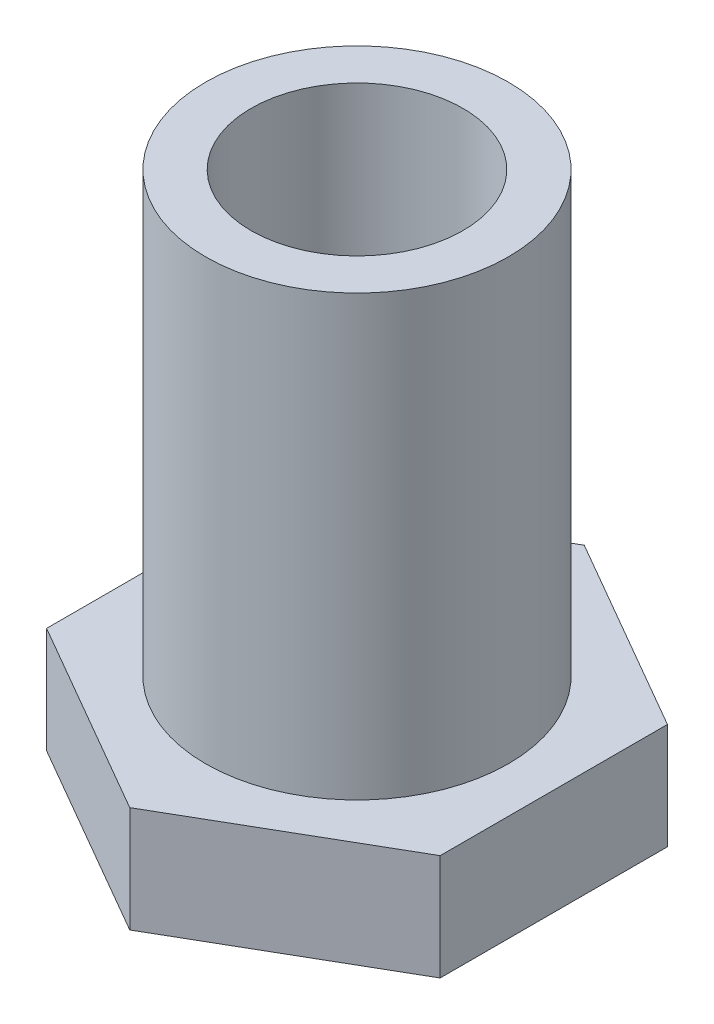
ISO-10303-21;
HEADER;
FILE_DESCRIPTION(('STEP AP214'),'2;1');
FILE_NAME('part.step','',(''),(''),'','','');
FILE_SCHEMA(('AUTOMOTIVE_DESIGN { 1 0 10303 214 1 1 1 1 }'));
ENDSEC;
DATA;
#1=APPLICATION_CONTEXT('core data for automotive mechanical design processes');
#2=APPLICATION_PROTOCOL_DEFINITION('international standard','automotive_design',2000,#1);
#3=PRODUCT_CONTEXT('',#1,'mechanical');
#4=PRODUCT('Part','Part','',(#3));
#5=PRODUCT_RELATED_PRODUCT_CATEGORY('part','',(#4));
#6=PRODUCT_DEFINITION_FORMATION('','',#4);
#7=PRODUCT_DEFINITION_CONTEXT('part definition',#1,'design');
#8=PRODUCT_DEFINITION('design','',#6,#7);
#9=PRODUCT_DEFINITION_SHAPE('','',#8);
#10=(LENGTH_UNIT() NAMED_UNIT(*) SI_UNIT(.MILLI.,.METRE.));
#11=(NAMED_UNIT(*) PLANE_ANGLE_UNIT() SI_UNIT($,.RADIAN.));
#12=(NAMED_UNIT(*) SI_UNIT($,.STERADIAN.) SOLID_ANGLE_UNIT());
#13=UNCERTAINTY_MEASURE_WITH_UNIT(LENGTH_MEASURE(1.E-05),#10,'distance_accuracy_value','');
#14=(GEOMETRIC_REPRESENTATION_CONTEXT(3) GLOBAL_UNCERTAINTY_ASSIGNED_CONTEXT((#13)) GLOBAL_UNIT_ASSIGNED_CONTEXT((#10,
#11,#12)) REPRESENTATION_CONTEXT('',''));
#15=CARTESIAN_POINT('',(0.,0.,0.));
#16=DIRECTION('',(0.,0.,1.));
#17=DIRECTION('',(1.,0.,0.));
#18=AXIS2_PLACEMENT_3D('',#15,#16,#17);
#19=CARTESIAN_POINT('',(0.,18.,0.));
#20=DIRECTION('',(0.,-1.,0.));
#21=DIRECTION('',(0.,0.,-1.));
#22=AXIS2_PLACEMENT_3D('',#19,#20,#21);
#23=CYLINDRICAL_SURFACE('',#22,3.5);
#24=CARTESIAN_POINT('',(0.,18.,0.));
#25=DIRECTION('',(0.,1.,0.));
#26=DIRECTION('',(0.,0.,1.));
#27=AXIS2_PLACEMENT_3D('',#24,#25,#26);
#28=CIRCLE('',#27,3.5);
#29=CARTESIAN_POINT('',(0.,18.,3.5));
#30=VERTEX_POINT('',#29);
#31=EDGE_CURVE('E49',#30,#30,#28,.T.);
#32=ORIENTED_EDGE('',*,*,#31,.T.);
#33=EDGE_LOOP('',(#32));
#34=FACE_BOUND('',#33,.T.);
#35=CARTESIAN_POINT('',(0.,0.,0.));
#36=DIRECTION('',(0.,1.,0.));
#37=DIRECTION('',(0.,0.,1.));
#38=AXIS2_PLACEMENT_3D('',#35,#36,#37);
#39=CIRCLE('',#38,3.5);
#40=CARTESIAN_POINT('',(0.,0.,3.5));
#41=VERTEX_POINT('',#40);
#42=EDGE_CURVE('E43',#41,#41,#39,.T.);
#43=ORIENTED_EDGE('',*,*,#42,.F.);
#44=EDGE_LOOP('',(#43));
#45=FACE_BOUND('',#44,.T.);
#46=ADVANCED_FACE('F40',(#34,#45),#23,.F.);
#47=CARTESIAN_POINT('',(0.,18.,0.));
#48=DIRECTION('',(0.,-1.,0.));
#49=DIRECTION('',(0.,0.,-1.));
#50=AXIS2_PLACEMENT_3D('',#47,#48,#49);
#51=CYLINDRICAL_SURFACE('',#50,5.);
#52=CARTESIAN_POINT('',(0.,3.5,0.));
#53=DIRECTION('',(0.,1.,0.));
#54=DIRECTION('',(0.,0.,1.));
#55=AXIS2_PLACEMENT_3D('',#52,#53,#54);
#56=CIRCLE('',#55,5.);
#57=CARTESIAN_POINT('',(0.,3.5,5.));
#58=VERTEX_POINT('',#57);
#59=EDGE_CURVE('E139',#58,#58,#56,.T.);
#60=ORIENTED_EDGE('',*,*,#59,.T.);
#61=EDGE_LOOP('',(#60));
#62=FACE_BOUND('',#61,.T.);
#63=CARTESIAN_POINT('',(0.,18.,0.));
#64=DIRECTION('',(0.,1.,0.));
#65=DIRECTION('',(0.,0.,1.));
#66=AXIS2_PLACEMENT_3D('',#63,#64,#65);
#67=CIRCLE('',#66,5.);
#68=CARTESIAN_POINT('',(0.,18.,5.));
#69=VERTEX_POINT('',#68);
#70=EDGE_CURVE('E11',#69,#69,#67,.T.);
#71=ORIENTED_EDGE('',*,*,#70,.F.);
#72=EDGE_LOOP('',(#71));
#73=FACE_BOUND('',#72,.T.);
#74=ADVANCED_FACE('F160',(#62,#73),#51,.T.);
#75=CARTESIAN_POINT('',(0.,18.,0.));
#76=DIRECTION('',(0.,1.,0.));
#77=DIRECTION('',(0.,0.,1.));
#78=AXIS2_PLACEMENT_3D('',#75,#76,#77);
#79=PLANE('',#78);
#80=ORIENTED_EDGE('',*,*,#31,.F.);
#81=EDGE_LOOP('',(#80));
#82=FACE_BOUND('',#81,.T.);
#83=ORIENTED_EDGE('',*,*,#70,.T.);
#84=EDGE_LOOP('',(#83));
#85=FACE_BOUND('',#84,.T.);
#86=ADVANCED_FACE('F164',(#82,#85),#79,.T.);
#87=CARTESIAN_POINT('',(0.,0.,0.));
#88=DIRECTION('',(0.,1.,0.));
#89=DIRECTION('',(0.,0.,1.));
#90=AXIS2_PLACEMENT_3D('',#87,#88,#89);
#91=PLANE('',#90);
#92=ORIENTED_EDGE('',*,*,#42,.T.);
#93=EDGE_LOOP('',(#92));
#94=FACE_BOUND('',#93,.T.);
#95=DIRECTION('',(0.,0.,-1.));
#96=VECTOR('',#95,1.);
#97=CARTESIAN_POINT('',(6.5,0.,0.));
#98=LINE('',#97,#96);
#99=CARTESIAN_POINT('',(6.5,0.,3.75277674973258));
#100=VERTEX_POINT('',#99);
#101=CARTESIAN_POINT('',(6.5,0.,-3.75277674973257));
#102=VERTEX_POINT('',#101);
#103=EDGE_CURVE('E129',#100,#102,#98,.T.);
#104=ORIENTED_EDGE('',*,*,#103,.F.);
#105=DIRECTION('',(0.866025403784439,0.,-0.5));
#106=VECTOR('',#105,1.);
#107=CARTESIAN_POINT('',(3.25,0.,5.62916512459886));
#108=LINE('',#107,#106);
#109=CARTESIAN_POINT('',(0.,0.,7.50555349946514));
#110=VERTEX_POINT('',#109);
#111=EDGE_CURVE('E88',#110,#100,#108,.T.);
#112=ORIENTED_EDGE('',*,*,#111,.F.);
#113=DIRECTION('',(0.866025403784439,0.,0.5));
#114=VECTOR('',#113,1.);
#115=CARTESIAN_POINT('',(-3.25000000000001,0.,5.62916512459886));
#116=LINE('',#115,#114);
#117=CARTESIAN_POINT('',(-6.5,0.,3.75277674973257));
#118=VERTEX_POINT('',#117);
#119=EDGE_CURVE('E82',#118,#110,#116,.T.);
#120=ORIENTED_EDGE('',*,*,#119,.F.);
#121=DIRECTION('',(0.,0.,1.));
#122=VECTOR('',#121,1.);
#123=CARTESIAN_POINT('',(-6.5,0.,0.));
#124=LINE('',#123,#122);
#125=CARTESIAN_POINT('',(-6.5,0.,-3.75277674973257));
#126=VERTEX_POINT('',#125);
#127=EDGE_CURVE('E118',#126,#118,#124,.T.);
#128=ORIENTED_EDGE('',*,*,#127,.F.);
#129=DIRECTION('',(-0.866025403784439,0.,0.5));
#130=VECTOR('',#129,1.);
#131=CARTESIAN_POINT('',(-3.25,0.,-5.62916512459885));
#132=LINE('',#131,#130);
#133=CARTESIAN_POINT('',(0.,0.,-7.50555349946514));
#134=VERTEX_POINT('',#133);
#135=EDGE_CURVE('E134',#134,#126,#132,.T.);
#136=ORIENTED_EDGE('',*,*,#135,.F.);
#137=DIRECTION('',(-0.866025403784439,0.,-0.5));
#138=VECTOR('',#137,1.);
#139=CARTESIAN_POINT('',(3.25,0.,-5.62916512459885));
#140=LINE('',#139,#138);
#141=EDGE_CURVE('E132',#102,#134,#140,.T.);
#142=ORIENTED_EDGE('',*,*,#141,.F.);
#143=EDGE_LOOP('',(#104,#112,#120,#128,#136,#142));
#144=FACE_BOUND('',#143,.T.);
#145=ADVANCED_FACE('F156',(#94,#144),#91,.F.);
#146=CARTESIAN_POINT('',(6.5,3.5,0.));
#147=DIRECTION('',(-1.,0.,0.));
#148=DIRECTION('',(0.,0.,1.));
#149=AXIS2_PLACEMENT_3D('',#146,#147,#148);
#150=PLANE('',#149);
#151=ORIENTED_EDGE('',*,*,#103,.T.);
#152=DIRECTION('',(0.,-1.,0.));
#153=VECTOR('',#152,1.);
#154=CARTESIAN_POINT('',(6.5,3.5,-3.75277674973257));
#155=LINE('',#154,#153);
#156=CARTESIAN_POINT('',(6.5,3.5,-3.75277674973257));
#157=VERTEX_POINT('',#156);
#158=EDGE_CURVE('E147',#157,#102,#155,.T.);
#159=ORIENTED_EDGE('',*,*,#158,.F.);
#160=DIRECTION('',(0.,0.,-1.));
#161=VECTOR('',#160,1.);
#162=CARTESIAN_POINT('',(6.5,3.5,0.));
#163=LINE('',#162,#161);
#164=CARTESIAN_POINT('',(6.5,3.5,3.75277674973258));
#165=VERTEX_POINT('',#164);
#166=EDGE_CURVE('E200',#165,#157,#163,.T.);
#167=ORIENTED_EDGE('',*,*,#166,.F.);
#168=DIRECTION('',(0.,-1.,0.));
#169=VECTOR('',#168,1.);
#170=CARTESIAN_POINT('',(6.5,3.5,3.75277674973258));
#171=LINE('',#170,#169);
#172=EDGE_CURVE('E125',#165,#100,#171,.T.);
#173=ORIENTED_EDGE('',*,*,#172,.T.);
#174=EDGE_LOOP('',(#151,#159,#167,#173));
#175=FACE_BOUND('',#174,.T.);
#176=ADVANCED_FACE('F175',(#175),#150,.F.);
#177=CARTESIAN_POINT('',(3.25,3.5,-5.62916512459885));
#178=DIRECTION('',(-0.5,0.,0.866025403784439));
#179=DIRECTION('',(0.866025403784439,0.,0.5));
#180=AXIS2_PLACEMENT_3D('',#177,#178,#179);
#181=PLANE('',#180);
#182=ORIENTED_EDGE('',*,*,#141,.T.);
#183=DIRECTION('',(0.,-1.,0.));
#184=VECTOR('',#183,1.);
#185=CARTESIAN_POINT('',(0.,3.5,-7.50555349946514));
#186=LINE('',#185,#184);
#187=CARTESIAN_POINT('',(0.,3.5,-7.50555349946514));
#188=VERTEX_POINT('',#187);
#189=EDGE_CURVE('E144',#188,#134,#186,.T.);
#190=ORIENTED_EDGE('',*,*,#189,.F.);
#191=DIRECTION('',(-0.866025403784439,0.,-0.5));
#192=VECTOR('',#191,1.);
#193=CARTESIAN_POINT('',(3.25,3.5,-5.62916512459885));
#194=LINE('',#193,#192);
#195=EDGE_CURVE('E97',#157,#188,#194,.T.);
#196=ORIENTED_EDGE('',*,*,#195,.F.);
#197=ORIENTED_EDGE('',*,*,#158,.T.);
#198=EDGE_LOOP('',(#182,#190,#196,#197));
#199=FACE_BOUND('',#198,.T.);
#200=ADVANCED_FACE('F179',(#199),#181,.F.);
#201=CARTESIAN_POINT('',(-3.25,3.5,-5.62916512459885));
#202=DIRECTION('',(0.5,0.,0.866025403784439));
#203=DIRECTION('',(0.866025403784439,0.,-0.5));
#204=AXIS2_PLACEMENT_3D('',#201,#202,#203);
#205=PLANE('',#204);
#206=ORIENTED_EDGE('',*,*,#135,.T.);
#207=DIRECTION('',(0.,-1.,0.));
#208=VECTOR('',#207,1.);
#209=CARTESIAN_POINT('',(-6.5,3.5,-3.75277674973257));
#210=LINE('',#209,#208);
#211=CARTESIAN_POINT('',(-6.5,3.5,-3.75277674973257));
#212=VERTEX_POINT('',#211);
#213=EDGE_CURVE('E119',#212,#126,#210,.T.);
#214=ORIENTED_EDGE('',*,*,#213,.F.);
#215=DIRECTION('',(-0.866025403784439,0.,0.5));
#216=VECTOR('',#215,1.);
#217=CARTESIAN_POINT('',(-3.25,3.5,-5.62916512459885));
#218=LINE('',#217,#216);
#219=EDGE_CURVE('E110',#188,#212,#218,.T.);
#220=ORIENTED_EDGE('',*,*,#219,.F.);
#221=ORIENTED_EDGE('',*,*,#189,.T.);
#222=EDGE_LOOP('',(#206,#214,#220,#221));
#223=FACE_BOUND('',#222,.T.);
#224=ADVANCED_FACE('F183',(#223),#205,.F.);
#225=CARTESIAN_POINT('',(-6.5,3.5,0.));
#226=DIRECTION('',(1.,0.,0.));
#227=DIRECTION('',(0.,0.,-1.));
#228=AXIS2_PLACEMENT_3D('',#225,#226,#227);
#229=PLANE('',#228);
#230=ORIENTED_EDGE('',*,*,#127,.T.);
#231=DIRECTION('',(0.,-1.,0.));
#232=VECTOR('',#231,1.);
#233=CARTESIAN_POINT('',(-6.5,3.5,3.75277674973257));
#234=LINE('',#233,#232);
#235=CARTESIAN_POINT('',(-6.5,3.5,3.75277674973257));
#236=VERTEX_POINT('',#235);
#237=EDGE_CURVE('E115',#236,#118,#234,.T.);
#238=ORIENTED_EDGE('',*,*,#237,.F.);
#239=DIRECTION('',(0.,0.,1.));
#240=VECTOR('',#239,1.);
#241=CARTESIAN_POINT('',(-6.5,3.5,0.));
#242=LINE('',#241,#240);
#243=EDGE_CURVE('E104',#212,#236,#242,.T.);
#244=ORIENTED_EDGE('',*,*,#243,.F.);
#245=ORIENTED_EDGE('',*,*,#213,.T.);
#246=EDGE_LOOP('',(#230,#238,#244,#245));
#247=FACE_BOUND('',#246,.T.);
#248=ADVANCED_FACE('F116',(#247),#229,.F.);
#249=CARTESIAN_POINT('',(-3.25000000000001,3.5,5.62916512459886));
#250=DIRECTION('',(0.5,0.,-0.866025403784438));
#251=DIRECTION('',(-0.866025403784438,0.,-0.5));
#252=AXIS2_PLACEMENT_3D('',#249,#250,#251);
#253=PLANE('',#252);
#254=ORIENTED_EDGE('',*,*,#119,.T.);
#255=DIRECTION('',(0.,-1.,0.));
#256=VECTOR('',#255,1.);
#257=CARTESIAN_POINT('',(0.,3.5,7.50555349946514));
#258=LINE('',#257,#256);
#259=CARTESIAN_POINT('',(0.,3.5,7.50555349946514));
#260=VERTEX_POINT('',#259);
#261=EDGE_CURVE('E120',#260,#110,#258,.T.);
#262=ORIENTED_EDGE('',*,*,#261,.F.);
#263=DIRECTION('',(0.866025403784439,0.,0.5));
#264=VECTOR('',#263,1.);
#265=CARTESIAN_POINT('',(-3.25000000000001,3.5,5.62916512459886));
#266=LINE('',#265,#264);
#267=EDGE_CURVE('E108',#236,#260,#266,.T.);
#268=ORIENTED_EDGE('',*,*,#267,.F.);
#269=ORIENTED_EDGE('',*,*,#237,.T.);
#270=EDGE_LOOP('',(#254,#262,#268,#269));
#271=FACE_BOUND('',#270,.T.);
#272=ADVANCED_FACE('F122',(#271),#253,.F.);
#273=CARTESIAN_POINT('',(3.25,3.5,5.62916512459886));
#274=DIRECTION('',(-0.5,0.,-0.866025403784439));
#275=DIRECTION('',(-0.866025403784439,0.,0.5));
#276=AXIS2_PLACEMENT_3D('',#273,#274,#275);
#277=PLANE('',#276);
#278=ORIENTED_EDGE('',*,*,#111,.T.);
#279=ORIENTED_EDGE('',*,*,#172,.F.);
#280=DIRECTION('',(0.866025403784439,0.,-0.5));
#281=VECTOR('',#280,1.);
#282=CARTESIAN_POINT('',(3.25,3.5,5.62916512459886));
#283=LINE('',#282,#281);
#284=EDGE_CURVE('E59',#260,#165,#283,.T.);
#285=ORIENTED_EDGE('',*,*,#284,.F.);
#286=ORIENTED_EDGE('',*,*,#261,.T.);
#287=EDGE_LOOP('',(#278,#279,#285,#286));
#288=FACE_BOUND('',#287,.T.);
#289=ADVANCED_FACE('F191',(#288),#277,.F.);
#290=CARTESIAN_POINT('',(0.,3.5,0.));
#291=DIRECTION('',(0.,1.,0.));
#292=DIRECTION('',(0.,0.,1.));
#293=AXIS2_PLACEMENT_3D('',#290,#291,#292);
#294=PLANE('',#293);
#295=ORIENTED_EDGE('',*,*,#59,.F.);
#296=EDGE_LOOP('',(#295));
#297=FACE_BOUND('',#296,.T.);
#298=ORIENTED_EDGE('',*,*,#166,.T.);
#299=ORIENTED_EDGE('',*,*,#195,.T.);
#300=ORIENTED_EDGE('',*,*,#219,.T.);
#301=ORIENTED_EDGE('',*,*,#243,.T.);
#302=ORIENTED_EDGE('',*,*,#267,.T.);
#303=ORIENTED_EDGE('',*,*,#284,.T.);
#304=EDGE_LOOP('',(#298,#299,#300,#301,#302,#303));
#305=FACE_BOUND('',#304,.T.);
#306=ADVANCED_FACE('F106',(#297,#305),#294,.T.);
#307=CLOSED_SHELL('',(#46,#74,#86,#145,#176,#200,#224,#248,#272,#289,#306));
#308=MANIFOLD_SOLID_BREP('B2',#307);
#309=ADVANCED_BREP_SHAPE_REPRESENTATION('',(#18,#308),#14);
#310=SHAPE_DEFINITION_REPRESENTATION(#9,#309);
ENDSEC;
END-ISO-10303-21;
